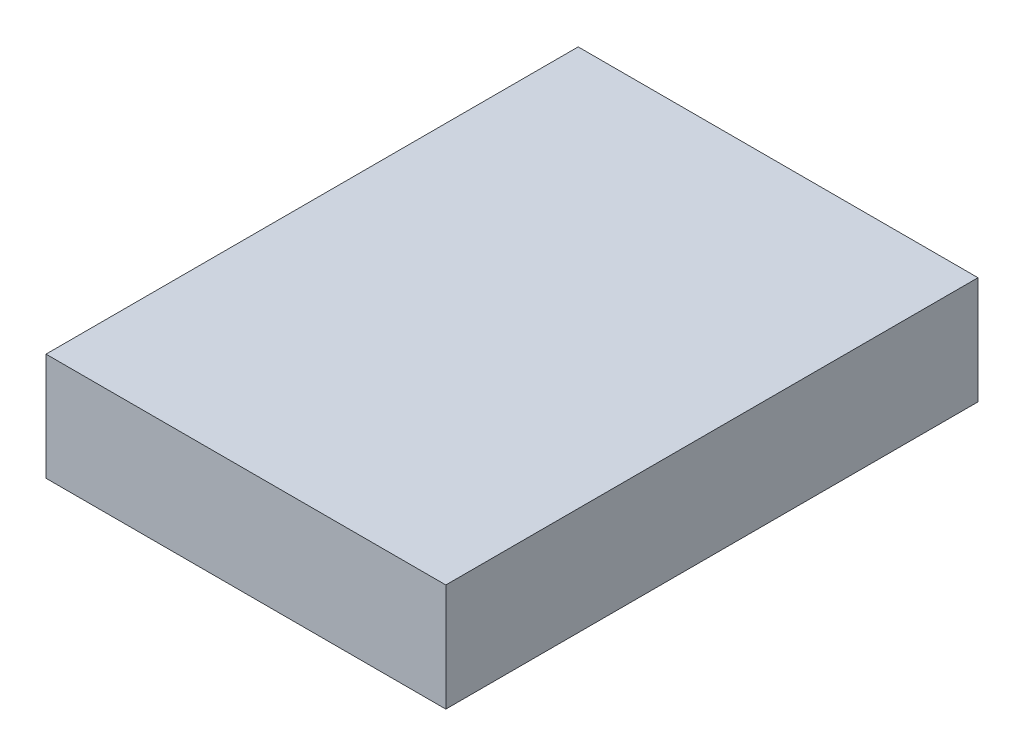
ISO-10303-21;
HEADER;
FILE_DESCRIPTION(('STEP AP214'),'2;1');
FILE_NAME('part.step','',(''),(''),'','','');
FILE_SCHEMA(('AUTOMOTIVE_DESIGN { 1 0 10303 214 1 1 1 1 }'));
ENDSEC;
DATA;
#1=APPLICATION_CONTEXT('core data for automotive mechanical design processes');
#2=APPLICATION_PROTOCOL_DEFINITION('international standard','automotive_design',2000,#1);
#3=PRODUCT_CONTEXT('',#1,'mechanical');
#4=PRODUCT('Part','Part','',(#3));
#5=PRODUCT_RELATED_PRODUCT_CATEGORY('part','',(#4));
#6=PRODUCT_DEFINITION_FORMATION('','',#4);
#7=PRODUCT_DEFINITION_CONTEXT('part definition',#1,'design');
#8=PRODUCT_DEFINITION('design','',#6,#7);
#9=PRODUCT_DEFINITION_SHAPE('','',#8);
#10=(LENGTH_UNIT() NAMED_UNIT(*) SI_UNIT(.MILLI.,.METRE.));
#11=(NAMED_UNIT(*) PLANE_ANGLE_UNIT() SI_UNIT($,.RADIAN.));
#12=(NAMED_UNIT(*) SI_UNIT($,.STERADIAN.) SOLID_ANGLE_UNIT());
#13=UNCERTAINTY_MEASURE_WITH_UNIT(LENGTH_MEASURE(1.E-05),#10,'distance_accuracy_value','');
#14=(GEOMETRIC_REPRESENTATION_CONTEXT(3) GLOBAL_UNCERTAINTY_ASSIGNED_CONTEXT((#13)) GLOBAL_UNIT_ASSIGNED_CONTEXT((#10,
#11,#12)) REPRESENTATION_CONTEXT('',''));
#15=CARTESIAN_POINT('',(0.,0.,0.));
#16=DIRECTION('',(0.,0.,1.));
#17=DIRECTION('',(1.,0.,0.));
#18=AXIS2_PLACEMENT_3D('',#15,#16,#17);
#19=CARTESIAN_POINT('',(0.,19.5,0.));
#20=DIRECTION('',(1.,0.,0.));
#21=DIRECTION('',(0.,0.,-1.));
#22=AXIS2_PLACEMENT_3D('',#19,#20,#21);
#23=PLANE('',#22);
#24=DIRECTION('',(0.,0.,1.));
#25=VECTOR('',#24,1.);
#26=CARTESIAN_POINT('',(0.,0.,0.));
#27=LINE('',#26,#25);
#28=CARTESIAN_POINT('',(0.,0.,-96.5));
#29=VERTEX_POINT('',#28);
#30=CARTESIAN_POINT('',(0.,0.,0.));
#31=VERTEX_POINT('',#30);
#32=EDGE_CURVE('E95',#29,#31,#27,.T.);
#33=ORIENTED_EDGE('',*,*,#32,.T.);
#34=DIRECTION('',(0.,-1.,0.));
#35=VECTOR('',#34,1.);
#36=CARTESIAN_POINT('',(0.,19.5,0.));
#37=LINE('',#36,#35);
#38=CARTESIAN_POINT('',(0.,19.5,0.));
#39=VERTEX_POINT('',#38);
#40=EDGE_CURVE('E11',#39,#31,#37,.T.);
#41=ORIENTED_EDGE('',*,*,#40,.F.);
#42=DIRECTION('',(0.,0.,1.));
#43=VECTOR('',#42,1.);
#44=CARTESIAN_POINT('',(0.,19.5,0.));
#45=LINE('',#44,#43);
#46=CARTESIAN_POINT('',(0.,19.5,-96.5));
#47=VERTEX_POINT('',#46);
#48=EDGE_CURVE('E83',#47,#39,#45,.T.);
#49=ORIENTED_EDGE('',*,*,#48,.F.);
#50=DIRECTION('',(0.,-1.,0.));
#51=VECTOR('',#50,1.);
#52=CARTESIAN_POINT('',(0.,19.5,-96.5));
#53=LINE('',#52,#51);
#54=EDGE_CURVE('E91',#47,#29,#53,.T.);
#55=ORIENTED_EDGE('',*,*,#54,.T.);
#56=EDGE_LOOP('',(#33,#41,#49,#55));
#57=FACE_BOUND('',#56,.T.);
#58=ADVANCED_FACE('F32',(#57),#23,.F.);
#59=CARTESIAN_POINT('',(0.,19.5,0.));
#60=DIRECTION('',(0.,0.,-1.));
#61=DIRECTION('',(-1.,0.,0.));
#62=AXIS2_PLACEMENT_3D('',#59,#60,#61);
#63=PLANE('',#62);
#64=DIRECTION('',(1.,0.,0.));
#65=VECTOR('',#64,1.);
#66=CARTESIAN_POINT('',(0.,0.,0.));
#67=LINE('',#66,#65);
#68=CARTESIAN_POINT('',(72.5,0.,0.));
#69=VERTEX_POINT('',#68);
#70=EDGE_CURVE('E87',#31,#69,#67,.T.);
#71=ORIENTED_EDGE('',*,*,#70,.T.);
#72=DIRECTION('',(0.,-1.,0.));
#73=VECTOR('',#72,1.);
#74=CARTESIAN_POINT('',(72.5,19.5,0.));
#75=LINE('',#74,#73);
#76=CARTESIAN_POINT('',(72.5,19.5,0.));
#77=VERTEX_POINT('',#76);
#78=EDGE_CURVE('E40',#77,#69,#75,.T.);
#79=ORIENTED_EDGE('',*,*,#78,.F.);
#80=DIRECTION('',(1.,0.,0.));
#81=VECTOR('',#80,1.);
#82=CARTESIAN_POINT('',(0.,19.5,0.));
#83=LINE('',#82,#81);
#84=EDGE_CURVE('E78',#39,#77,#83,.T.);
#85=ORIENTED_EDGE('',*,*,#84,.F.);
#86=ORIENTED_EDGE('',*,*,#40,.T.);
#87=EDGE_LOOP('',(#71,#79,#85,#86));
#88=FACE_BOUND('',#87,.T.);
#89=ADVANCED_FACE('F86',(#88),#63,.F.);
#90=CARTESIAN_POINT('',(72.5,19.5,0.));
#91=DIRECTION('',(-1.,0.,0.));
#92=DIRECTION('',(0.,0.,1.));
#93=AXIS2_PLACEMENT_3D('',#90,#91,#92);
#94=PLANE('',#93);
#95=DIRECTION('',(0.,0.,-1.));
#96=VECTOR('',#95,1.);
#97=CARTESIAN_POINT('',(72.5,0.,0.));
#98=LINE('',#97,#96);
#99=CARTESIAN_POINT('',(72.5,0.,-96.5));
#100=VERTEX_POINT('',#99);
#101=EDGE_CURVE('E65',#69,#100,#98,.T.);
#102=ORIENTED_EDGE('',*,*,#101,.T.);
#103=DIRECTION('',(0.,-1.,0.));
#104=VECTOR('',#103,1.);
#105=CARTESIAN_POINT('',(72.5,19.5,-96.5));
#106=LINE('',#105,#104);
#107=CARTESIAN_POINT('',(72.5,19.5,-96.5));
#108=VERTEX_POINT('',#107);
#109=EDGE_CURVE('E88',#108,#100,#106,.T.);
#110=ORIENTED_EDGE('',*,*,#109,.F.);
#111=DIRECTION('',(0.,0.,-1.));
#112=VECTOR('',#111,1.);
#113=CARTESIAN_POINT('',(72.5,19.5,0.));
#114=LINE('',#113,#112);
#115=EDGE_CURVE('E81',#77,#108,#114,.T.);
#116=ORIENTED_EDGE('',*,*,#115,.F.);
#117=ORIENTED_EDGE('',*,*,#78,.T.);
#118=EDGE_LOOP('',(#102,#110,#116,#117));
#119=FACE_BOUND('',#118,.T.);
#120=ADVANCED_FACE('F89',(#119),#94,.F.);
#121=CARTESIAN_POINT('',(0.,19.5,-96.5));
#122=DIRECTION('',(0.,0.,1.));
#123=DIRECTION('',(1.,0.,0.));
#124=AXIS2_PLACEMENT_3D('',#121,#122,#123);
#125=PLANE('',#124);
#126=DIRECTION('',(-1.,0.,0.));
#127=VECTOR('',#126,1.);
#128=CARTESIAN_POINT('',(0.,0.,-96.5));
#129=LINE('',#128,#127);
#130=EDGE_CURVE('E71',#100,#29,#129,.T.);
#131=ORIENTED_EDGE('',*,*,#130,.T.);
#132=ORIENTED_EDGE('',*,*,#54,.F.);
#133=DIRECTION('',(-1.,0.,0.));
#134=VECTOR('',#133,1.);
#135=CARTESIAN_POINT('',(0.,19.5,-96.5));
#136=LINE('',#135,#134);
#137=EDGE_CURVE('E48',#108,#47,#136,.T.);
#138=ORIENTED_EDGE('',*,*,#137,.F.);
#139=ORIENTED_EDGE('',*,*,#109,.T.);
#140=EDGE_LOOP('',(#131,#132,#138,#139));
#141=FACE_BOUND('',#140,.T.);
#142=ADVANCED_FACE('F102',(#141),#125,.F.);
#143=CARTESIAN_POINT('',(0.,19.5,0.));
#144=DIRECTION('',(0.,-1.,0.));
#145=DIRECTION('',(0.,0.,-1.));
#146=AXIS2_PLACEMENT_3D('',#143,#144,#145);
#147=PLANE('',#146);
#148=ORIENTED_EDGE('',*,*,#48,.T.);
#149=ORIENTED_EDGE('',*,*,#84,.T.);
#150=ORIENTED_EDGE('',*,*,#115,.T.);
#151=ORIENTED_EDGE('',*,*,#137,.T.);
#152=EDGE_LOOP('',(#148,#149,#150,#151));
#153=FACE_BOUND('',#152,.T.);
#154=ADVANCED_FACE('F79',(#153),#147,.F.);
#155=CARTESIAN_POINT('',(0.,0.,0.));
#156=DIRECTION('',(0.,-1.,0.));
#157=DIRECTION('',(0.,0.,-1.));
#158=AXIS2_PLACEMENT_3D('',#155,#156,#157);
#159=PLANE('',#158);
#160=ORIENTED_EDGE('',*,*,#32,.F.);
#161=ORIENTED_EDGE('',*,*,#130,.F.);
#162=ORIENTED_EDGE('',*,*,#101,.F.);
#163=ORIENTED_EDGE('',*,*,#70,.F.);
#164=EDGE_LOOP('',(#160,#161,#162,#163));
#165=FACE_BOUND('',#164,.T.);
#166=ADVANCED_FACE('F105',(#165),#159,.T.);
#167=CLOSED_SHELL('',(#58,#89,#120,#142,#154,#166));
#168=MANIFOLD_SOLID_BREP('B2',#167);
#169=ADVANCED_BREP_SHAPE_REPRESENTATION('',(#18,#168),#14);
#170=SHAPE_DEFINITION_REPRESENTATION(#9,#169);
ENDSEC;
END-ISO-10303-21;
